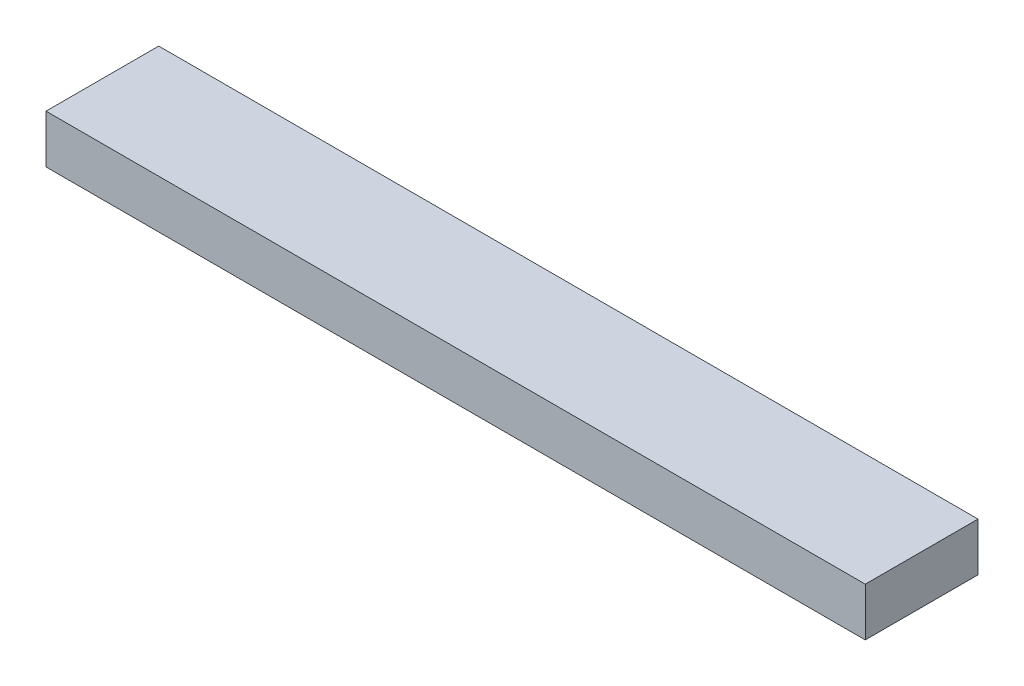
ISO-10303-21;
HEADER;
FILE_DESCRIPTION(('STEP AP214'),'2;1');
FILE_NAME('part.step','',(''),(''),'','','');
FILE_SCHEMA(('AUTOMOTIVE_DESIGN { 1 0 10303 214 1 1 1 1 }'));
ENDSEC;
DATA;
#1=APPLICATION_CONTEXT('core data for automotive mechanical design processes');
#2=APPLICATION_PROTOCOL_DEFINITION('international standard','automotive_design',2000,#1);
#3=PRODUCT_CONTEXT('',#1,'mechanical');
#4=PRODUCT('Part','Part','',(#3));
#5=PRODUCT_RELATED_PRODUCT_CATEGORY('part','',(#4));
#6=PRODUCT_DEFINITION_FORMATION('','',#4);
#7=PRODUCT_DEFINITION_CONTEXT('part definition',#1,'design');
#8=PRODUCT_DEFINITION('design','',#6,#7);
#9=PRODUCT_DEFINITION_SHAPE('','',#8);
#10=(LENGTH_UNIT() NAMED_UNIT(*) SI_UNIT(.MILLI.,.METRE.));
#11=(NAMED_UNIT(*) PLANE_ANGLE_UNIT() SI_UNIT($,.RADIAN.));
#12=(NAMED_UNIT(*) SI_UNIT($,.STERADIAN.) SOLID_ANGLE_UNIT());
#13=UNCERTAINTY_MEASURE_WITH_UNIT(LENGTH_MEASURE(1.E-05),#10,'distance_accuracy_value','');
#14=(GEOMETRIC_REPRESENTATION_CONTEXT(3) GLOBAL_UNCERTAINTY_ASSIGNED_CONTEXT((#13)) GLOBAL_UNIT_ASSIGNED_CONTEXT((#10,
#11,#12)) REPRESENTATION_CONTEXT('',''));
#15=CARTESIAN_POINT('',(0.,0.,0.));
#16=DIRECTION('',(0.,0.,1.));
#17=DIRECTION('',(1.,0.,0.));
#18=AXIS2_PLACEMENT_3D('',#15,#16,#17);
#19=CARTESIAN_POINT('',(0.,38.1,0.));
#20=DIRECTION('',(1.,0.,0.));
#21=DIRECTION('',(0.,0.,-1.));
#22=AXIS2_PLACEMENT_3D('',#19,#20,#21);
#23=PLANE('',#22);
#24=DIRECTION('',(0.,0.,1.));
#25=VECTOR('',#24,1.);
#26=CARTESIAN_POINT('',(0.,0.,0.));
#27=LINE('',#26,#25);
#28=CARTESIAN_POINT('',(0.,0.,-88.9));
#29=VERTEX_POINT('',#28);
#30=CARTESIAN_POINT('',(0.,0.,0.));
#31=VERTEX_POINT('',#30);
#32=EDGE_CURVE('E102',#29,#31,#27,.T.);
#33=ORIENTED_EDGE('',*,*,#32,.T.);
#34=DIRECTION('',(0.,-1.,0.));
#35=VECTOR('',#34,1.);
#36=CARTESIAN_POINT('',(0.,38.1,0.));
#37=LINE('',#36,#35);
#38=CARTESIAN_POINT('',(0.,38.1,0.));
#39=VERTEX_POINT('',#38);
#40=EDGE_CURVE('E11',#39,#31,#37,.T.);
#41=ORIENTED_EDGE('',*,*,#40,.F.);
#42=DIRECTION('',(0.,0.,1.));
#43=VECTOR('',#42,1.);
#44=CARTESIAN_POINT('',(0.,38.1,0.));
#45=LINE('',#44,#43);
#46=CARTESIAN_POINT('',(0.,38.1,-88.9));
#47=VERTEX_POINT('',#46);
#48=EDGE_CURVE('E90',#47,#39,#45,.T.);
#49=ORIENTED_EDGE('',*,*,#48,.F.);
#50=DIRECTION('',(0.,-1.,0.));
#51=VECTOR('',#50,1.);
#52=CARTESIAN_POINT('',(0.,38.1,-88.9));
#53=LINE('',#52,#51);
#54=EDGE_CURVE('E98',#47,#29,#53,.T.);
#55=ORIENTED_EDGE('',*,*,#54,.T.);
#56=EDGE_LOOP('',(#33,#41,#49,#55));
#57=FACE_BOUND('',#56,.T.);
#58=ADVANCED_FACE('F39',(#57),#23,.F.);
#59=CARTESIAN_POINT('',(0.,38.1,0.));
#60=DIRECTION('',(0.,0.,-1.));
#61=DIRECTION('',(-1.,0.,0.));
#62=AXIS2_PLACEMENT_3D('',#59,#60,#61);
#63=PLANE('',#62);
#64=DIRECTION('',(1.,0.,0.));
#65=VECTOR('',#64,1.);
#66=CARTESIAN_POINT('',(0.,0.,0.));
#67=LINE('',#66,#65);
#68=CARTESIAN_POINT('',(646.1125,0.,0.));
#69=VERTEX_POINT('',#68);
#70=EDGE_CURVE('E94',#31,#69,#67,.T.);
#71=ORIENTED_EDGE('',*,*,#70,.T.);
#72=DIRECTION('',(0.,-1.,0.));
#73=VECTOR('',#72,1.);
#74=CARTESIAN_POINT('',(646.1125,38.1,0.));
#75=LINE('',#74,#73);
#76=CARTESIAN_POINT('',(646.1125,38.1,0.));
#77=VERTEX_POINT('',#76);
#78=EDGE_CURVE('E47',#77,#69,#75,.T.);
#79=ORIENTED_EDGE('',*,*,#78,.F.);
#80=DIRECTION('',(1.,0.,0.));
#81=VECTOR('',#80,1.);
#82=CARTESIAN_POINT('',(0.,38.1,0.));
#83=LINE('',#82,#81);
#84=EDGE_CURVE('E85',#39,#77,#83,.T.);
#85=ORIENTED_EDGE('',*,*,#84,.F.);
#86=ORIENTED_EDGE('',*,*,#40,.T.);
#87=EDGE_LOOP('',(#71,#79,#85,#86));
#88=FACE_BOUND('',#87,.T.);
#89=ADVANCED_FACE('F93',(#88),#63,.F.);
#90=CARTESIAN_POINT('',(646.1125,38.1,0.));
#91=DIRECTION('',(-1.,0.,0.));
#92=DIRECTION('',(0.,0.,1.));
#93=AXIS2_PLACEMENT_3D('',#90,#91,#92);
#94=PLANE('',#93);
#95=DIRECTION('',(0.,0.,-1.));
#96=VECTOR('',#95,1.);
#97=CARTESIAN_POINT('',(646.1125,0.,0.));
#98=LINE('',#97,#96);
#99=CARTESIAN_POINT('',(646.1125,0.,-88.9));
#100=VERTEX_POINT('',#99);
#101=EDGE_CURVE('E72',#69,#100,#98,.T.);
#102=ORIENTED_EDGE('',*,*,#101,.T.);
#103=DIRECTION('',(0.,-1.,0.));
#104=VECTOR('',#103,1.);
#105=CARTESIAN_POINT('',(646.1125,38.1,-88.9));
#106=LINE('',#105,#104);
#107=CARTESIAN_POINT('',(646.1125,38.1,-88.9));
#108=VERTEX_POINT('',#107);
#109=EDGE_CURVE('E95',#108,#100,#106,.T.);
#110=ORIENTED_EDGE('',*,*,#109,.F.);
#111=DIRECTION('',(0.,0.,-1.));
#112=VECTOR('',#111,1.);
#113=CARTESIAN_POINT('',(646.1125,38.1,0.));
#114=LINE('',#113,#112);
#115=EDGE_CURVE('E88',#77,#108,#114,.T.);
#116=ORIENTED_EDGE('',*,*,#115,.F.);
#117=ORIENTED_EDGE('',*,*,#78,.T.);
#118=EDGE_LOOP('',(#102,#110,#116,#117));
#119=FACE_BOUND('',#118,.T.);
#120=ADVANCED_FACE('F96',(#119),#94,.F.);
#121=CARTESIAN_POINT('',(0.,38.1,-88.9));
#122=DIRECTION('',(0.,0.,1.));
#123=DIRECTION('',(1.,0.,0.));
#124=AXIS2_PLACEMENT_3D('',#121,#122,#123);
#125=PLANE('',#124);
#126=DIRECTION('',(-1.,0.,0.));
#127=VECTOR('',#126,1.);
#128=CARTESIAN_POINT('',(0.,0.,-88.9));
#129=LINE('',#128,#127);
#130=EDGE_CURVE('E78',#100,#29,#129,.T.);
#131=ORIENTED_EDGE('',*,*,#130,.T.);
#132=ORIENTED_EDGE('',*,*,#54,.F.);
#133=DIRECTION('',(-1.,0.,0.));
#134=VECTOR('',#133,1.);
#135=CARTESIAN_POINT('',(0.,38.1,-88.9));
#136=LINE('',#135,#134);
#137=EDGE_CURVE('E55',#108,#47,#136,.T.);
#138=ORIENTED_EDGE('',*,*,#137,.F.);
#139=ORIENTED_EDGE('',*,*,#109,.T.);
#140=EDGE_LOOP('',(#131,#132,#138,#139));
#141=FACE_BOUND('',#140,.T.);
#142=ADVANCED_FACE('F109',(#141),#125,.F.);
#143=CARTESIAN_POINT('',(0.,38.1,0.));
#144=DIRECTION('',(0.,-1.,0.));
#145=DIRECTION('',(0.,0.,-1.));
#146=AXIS2_PLACEMENT_3D('',#143,#144,#145);
#147=PLANE('',#146);
#148=ORIENTED_EDGE('',*,*,#48,.T.);
#149=ORIENTED_EDGE('',*,*,#84,.T.);
#150=ORIENTED_EDGE('',*,*,#115,.T.);
#151=ORIENTED_EDGE('',*,*,#137,.T.);
#152=EDGE_LOOP('',(#148,#149,#150,#151));
#153=FACE_BOUND('',#152,.T.);
#154=ADVANCED_FACE('F86',(#153),#147,.F.);
#155=CARTESIAN_POINT('',(0.,0.,0.));
#156=DIRECTION('',(0.,-1.,0.));
#157=DIRECTION('',(0.,0.,-1.));
#158=AXIS2_PLACEMENT_3D('',#155,#156,#157);
#159=PLANE('',#158);
#160=ORIENTED_EDGE('',*,*,#32,.F.);
#161=ORIENTED_EDGE('',*,*,#130,.F.);
#162=ORIENTED_EDGE('',*,*,#101,.F.);
#163=ORIENTED_EDGE('',*,*,#70,.F.);
#164=EDGE_LOOP('',(#160,#161,#162,#163));
#165=FACE_BOUND('',#164,.T.);
#166=ADVANCED_FACE('F112',(#165),#159,.T.);
#167=CLOSED_SHELL('',(#58,#89,#120,#142,#154,#166));
#168=MANIFOLD_SOLID_BREP('B2',#167);
#169=ADVANCED_BREP_SHAPE_REPRESENTATION('',(#18,#168),#14);
#170=SHAPE_DEFINITION_REPRESENTATION(#9,#169);
ENDSEC;
END-ISO-10303-21;
